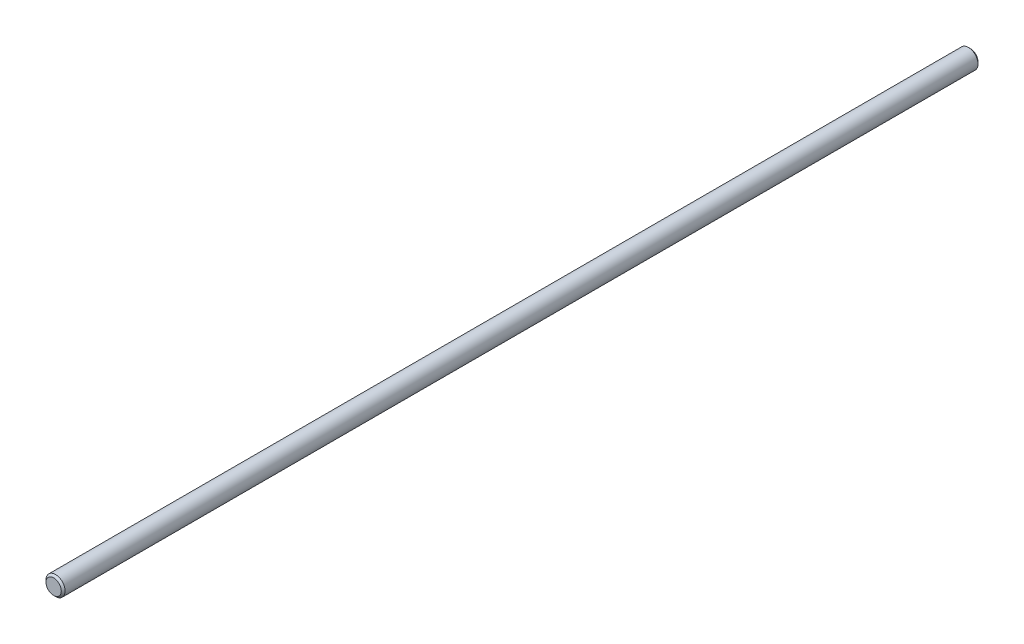
ISO-10303-21;
HEADER;
FILE_DESCRIPTION(('STEP AP214'),'2;1');
FILE_NAME('part.step','',(''),(''),'','','');
FILE_SCHEMA(('AUTOMOTIVE_DESIGN { 1 0 10303 214 1 1 1 1 }'));
ENDSEC;
DATA;
#1=APPLICATION_CONTEXT('core data for automotive mechanical design processes');
#2=APPLICATION_PROTOCOL_DEFINITION('international standard','automotive_design',2000,#1);
#3=PRODUCT_CONTEXT('',#1,'mechanical');
#4=PRODUCT('Part','Part','',(#3));
#5=PRODUCT_RELATED_PRODUCT_CATEGORY('part','',(#4));
#6=PRODUCT_DEFINITION_FORMATION('','',#4);
#7=PRODUCT_DEFINITION_CONTEXT('part definition',#1,'design');
#8=PRODUCT_DEFINITION('design','',#6,#7);
#9=PRODUCT_DEFINITION_SHAPE('','',#8);
#10=(LENGTH_UNIT() NAMED_UNIT(*) SI_UNIT(.MILLI.,.METRE.));
#11=(NAMED_UNIT(*) PLANE_ANGLE_UNIT() SI_UNIT($,.RADIAN.));
#12=(NAMED_UNIT(*) SI_UNIT($,.STERADIAN.) SOLID_ANGLE_UNIT());
#13=UNCERTAINTY_MEASURE_WITH_UNIT(LENGTH_MEASURE(1.E-05),#10,'distance_accuracy_value','');
#14=(GEOMETRIC_REPRESENTATION_CONTEXT(3) GLOBAL_UNCERTAINTY_ASSIGNED_CONTEXT((#13)) GLOBAL_UNIT_ASSIGNED_CONTEXT((#10,
#11,#12)) REPRESENTATION_CONTEXT('',''));
#15=CARTESIAN_POINT('',(0.,0.,0.));
#16=DIRECTION('',(0.,0.,1.));
#17=DIRECTION('',(1.,0.,0.));
#18=AXIS2_PLACEMENT_3D('',#15,#16,#17);
#19=CARTESIAN_POINT('',(0.,0.,609.6));
#20=DIRECTION('',(0.,0.,-1.));
#21=DIRECTION('',(-1.,0.,0.));
#22=AXIS2_PLACEMENT_3D('',#19,#20,#21);
#23=CYLINDRICAL_SURFACE('',#22,12.7);
#24=CARTESIAN_POINT('',(0.,0.,-607.059999999999));
#25=DIRECTION('',(0.,0.,1.));
#26=DIRECTION('',(1.,0.,0.));
#27=AXIS2_PLACEMENT_3D('',#24,#25,#26);
#28=CIRCLE('',#27,12.7);
#29=CARTESIAN_POINT('',(12.7,0.,-607.059999999999));
#30=VERTEX_POINT('',#29);
#31=EDGE_CURVE('E54',#30,#30,#28,.T.);
#32=ORIENTED_EDGE('',*,*,#31,.T.);
#33=EDGE_LOOP('',(#32));
#34=FACE_BOUND('',#33,.T.);
#35=CARTESIAN_POINT('',(0.,0.,607.060000000001));
#36=DIRECTION('',(0.,0.,1.));
#37=DIRECTION('',(1.,0.,0.));
#38=AXIS2_PLACEMENT_3D('',#35,#36,#37);
#39=CIRCLE('',#38,12.7);
#40=CARTESIAN_POINT('',(12.7,0.,607.060000000001));
#41=VERTEX_POINT('',#40);
#42=EDGE_CURVE('E59',#41,#41,#39,.F.);
#43=ORIENTED_EDGE('',*,*,#42,.T.);
#44=EDGE_LOOP('',(#43));
#45=FACE_BOUND('',#44,.T.);
#46=ADVANCED_FACE('F41',(#34,#45),#23,.T.);
#47=CARTESIAN_POINT('',(0.,0.,609.6));
#48=DIRECTION('',(0.,0.,1.));
#49=DIRECTION('',(1.,0.,0.));
#50=AXIS2_PLACEMENT_3D('',#47,#48,#49);
#51=PLANE('',#50);
#52=CARTESIAN_POINT('',(0.,0.,609.6));
#53=DIRECTION('',(0.,0.,1.));
#54=DIRECTION('',(1.,0.,0.));
#55=AXIS2_PLACEMENT_3D('',#52,#53,#54);
#56=CIRCLE('',#55,10.1600000000009);
#57=CARTESIAN_POINT('',(10.1600000000009,0.,609.6));
#58=VERTEX_POINT('',#57);
#59=EDGE_CURVE('E10',#58,#58,#56,.T.);
#60=ORIENTED_EDGE('',*,*,#59,.T.);
#61=EDGE_LOOP('',(#60));
#62=FACE_BOUND('',#61,.T.);
#63=ADVANCED_FACE('F76',(#62),#51,.T.);
#64=CARTESIAN_POINT('',(0.,0.,-609.6));
#65=DIRECTION('',(0.,0.,1.));
#66=DIRECTION('',(1.,0.,0.));
#67=AXIS2_PLACEMENT_3D('',#64,#65,#66);
#68=PLANE('',#67);
#69=CARTESIAN_POINT('',(0.,0.,-609.6));
#70=DIRECTION('',(0.,0.,1.));
#71=DIRECTION('',(1.,0.,0.));
#72=AXIS2_PLACEMENT_3D('',#69,#70,#71);
#73=CIRCLE('',#72,10.1599999999986);
#74=CARTESIAN_POINT('',(10.1599999999986,0.,-609.6));
#75=VERTEX_POINT('',#74);
#76=EDGE_CURVE('E49',#75,#75,#73,.F.);
#77=ORIENTED_EDGE('',*,*,#76,.T.);
#78=EDGE_LOOP('',(#77));
#79=FACE_BOUND('',#78,.T.);
#80=ADVANCED_FACE('F73',(#79),#68,.F.);
#81=CARTESIAN_POINT('',(0.,0.,-607.059999999999));
#82=DIRECTION('',(0.,0.,1.));
#83=DIRECTION('',(1.,0.,0.));
#84=AXIS2_PLACEMENT_3D('',#81,#82,#83);
#85=CONICAL_SURFACE('',#84,12.7,0.785398163397462);
#86=ORIENTED_EDGE('',*,*,#76,.F.);
#87=EDGE_LOOP('',(#86));
#88=FACE_BOUND('',#87,.T.);
#89=ORIENTED_EDGE('',*,*,#31,.F.);
#90=EDGE_LOOP('',(#89));
#91=FACE_BOUND('',#90,.T.);
#92=ADVANCED_FACE('F69',(#88,#91),#85,.T.);
#93=CARTESIAN_POINT('',(0.,0.,609.6));
#94=DIRECTION('',(0.,0.,-1.));
#95=DIRECTION('',(-1.,0.,0.));
#96=AXIS2_PLACEMENT_3D('',#93,#94,#95);
#97=CONICAL_SURFACE('',#96,10.1600000000009,0.78539816339744);
#98=ORIENTED_EDGE('',*,*,#42,.F.);
#99=EDGE_LOOP('',(#98));
#100=FACE_BOUND('',#99,.T.);
#101=ORIENTED_EDGE('',*,*,#59,.F.);
#102=EDGE_LOOP('',(#101));
#103=FACE_BOUND('',#102,.T.);
#104=ADVANCED_FACE('F43',(#100,#103),#97,.T.);
#105=CLOSED_SHELL('',(#46,#63,#80,#92,#104));
#106=MANIFOLD_SOLID_BREP('B2',#105);
#107=ADVANCED_BREP_SHAPE_REPRESENTATION('',(#18,#106),#14);
#108=SHAPE_DEFINITION_REPRESENTATION(#9,#107);
ENDSEC;
END-ISO-10303-21;
